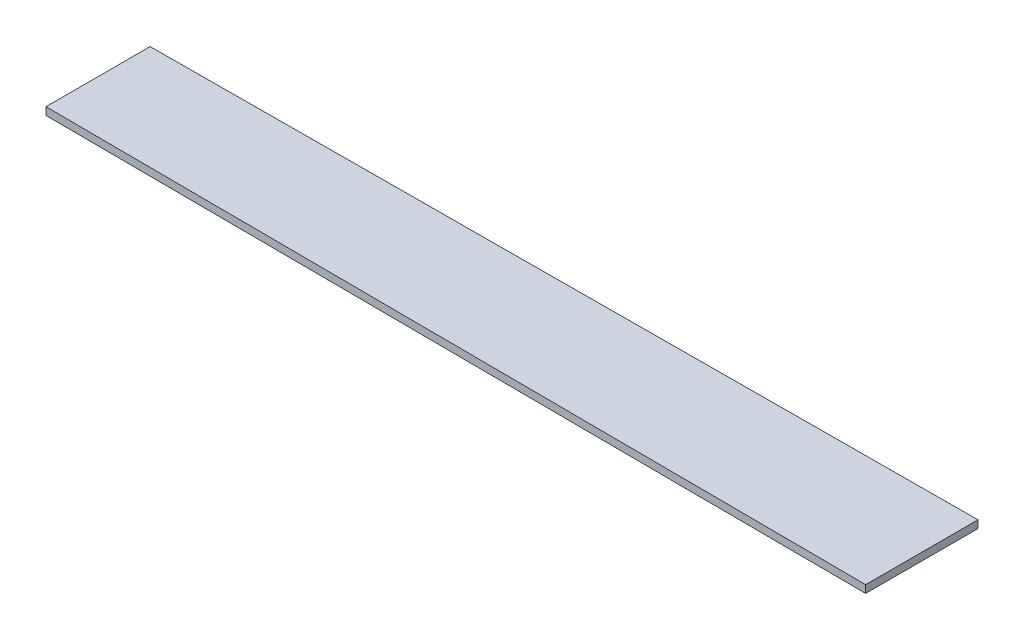
ISO-10303-21;
HEADER;
FILE_DESCRIPTION(('STEP AP214'),'2;1');
FILE_NAME('part.step','',(''),(''),'','','');
FILE_SCHEMA(('AUTOMOTIVE_DESIGN { 1 0 10303 214 1 1 1 1 }'));
ENDSEC;
DATA;
#1=APPLICATION_CONTEXT('core data for automotive mechanical design processes');
#2=APPLICATION_PROTOCOL_DEFINITION('international standard','automotive_design',2000,#1);
#3=PRODUCT_CONTEXT('',#1,'mechanical');
#4=PRODUCT('Part','Part','',(#3));
#5=PRODUCT_RELATED_PRODUCT_CATEGORY('part','',(#4));
#6=PRODUCT_DEFINITION_FORMATION('','',#4);
#7=PRODUCT_DEFINITION_CONTEXT('part definition',#1,'design');
#8=PRODUCT_DEFINITION('design','',#6,#7);
#9=PRODUCT_DEFINITION_SHAPE('','',#8);
#10=(LENGTH_UNIT() NAMED_UNIT(*) SI_UNIT(.MILLI.,.METRE.));
#11=(NAMED_UNIT(*) PLANE_ANGLE_UNIT() SI_UNIT($,.RADIAN.));
#12=(NAMED_UNIT(*) SI_UNIT($,.STERADIAN.) SOLID_ANGLE_UNIT());
#13=UNCERTAINTY_MEASURE_WITH_UNIT(LENGTH_MEASURE(1.E-05),#10,'distance_accuracy_value','');
#14=(GEOMETRIC_REPRESENTATION_CONTEXT(3) GLOBAL_UNCERTAINTY_ASSIGNED_CONTEXT((#13)) GLOBAL_UNIT_ASSIGNED_CONTEXT((#10,
#11,#12)) REPRESENTATION_CONTEXT('',''));
#15=CARTESIAN_POINT('',(0.,0.,0.));
#16=DIRECTION('',(0.,0.,1.));
#17=DIRECTION('',(1.,0.,0.));
#18=AXIS2_PLACEMENT_3D('',#15,#16,#17);
#19=CARTESIAN_POINT('',(0.,3.,22.1250000000059));
#20=DIRECTION('',(0.0049999375011962,0.,-0.99998750023437));
#21=DIRECTION('',(-0.99998750023437,0.,-0.0049999375011962));
#22=AXIS2_PLACEMENT_3D('',#19,#20,#21);
#23=PLANE('',#22);
#24=DIRECTION('',(0.99998750023437,0.,0.0049999375011962));
#25=VECTOR('',#24,1.);
#26=CARTESIAN_POINT('',(0.,0.,22.1250000000059));
#27=LINE('',#26,#25);
#28=CARTESIAN_POINT('',(-324.386118768319,0.,20.5030694061565));
#29=VERTEX_POINT('',#28);
#30=CARTESIAN_POINT('',(0.,0.,22.1250000000059));
#31=VERTEX_POINT('',#30);
#32=EDGE_CURVE('E100',#29,#31,#27,.T.);
#33=ORIENTED_EDGE('',*,*,#32,.T.);
#34=DIRECTION('',(0.,-1.,0.));
#35=VECTOR('',#34,1.);
#36=CARTESIAN_POINT('',(0.,3.,22.1250000000059));
#37=LINE('',#36,#35);
#38=CARTESIAN_POINT('',(0.,3.,22.1250000000059));
#39=VERTEX_POINT('',#38);
#40=EDGE_CURVE('E11',#39,#31,#37,.T.);
#41=ORIENTED_EDGE('',*,*,#40,.F.);
#42=DIRECTION('',(0.99998750023437,0.,0.0049999375011962));
#43=VECTOR('',#42,1.);
#44=CARTESIAN_POINT('',(0.,3.,22.1250000000059));
#45=LINE('',#44,#43);
#46=CARTESIAN_POINT('',(-324.386118768319,3.,20.5030694061565));
#47=VERTEX_POINT('',#46);
#48=EDGE_CURVE('E88',#47,#39,#45,.T.);
#49=ORIENTED_EDGE('',*,*,#48,.F.);
#50=DIRECTION('',(0.,-1.,0.));
#51=VECTOR('',#50,1.);
#52=CARTESIAN_POINT('',(-324.386118768319,3.,20.5030694061565));
#53=LINE('',#52,#51);
#54=EDGE_CURVE('E96',#47,#29,#53,.T.);
#55=ORIENTED_EDGE('',*,*,#54,.T.);
#56=EDGE_LOOP('',(#33,#41,#49,#55));
#57=FACE_BOUND('',#56,.T.);
#58=ADVANCED_FACE('F37',(#57),#23,.F.);
#59=CARTESIAN_POINT('',(0.,3.,22.1250000000059));
#60=DIRECTION('',(-1.,0.,0.));
#61=DIRECTION('',(0.,0.,1.));
#62=AXIS2_PLACEMENT_3D('',#59,#60,#61);
#63=PLANE('',#62);
#64=DIRECTION('',(0.,0.,-1.));
#65=VECTOR('',#64,1.);
#66=CARTESIAN_POINT('',(0.,0.,22.1250000000059));
#67=LINE('',#66,#65);
#68=CARTESIAN_POINT('',(0.,0.,-22.125000000006));
#69=VERTEX_POINT('',#68);
#70=EDGE_CURVE('E92',#31,#69,#67,.T.);
#71=ORIENTED_EDGE('',*,*,#70,.T.);
#72=DIRECTION('',(0.,-1.,0.));
#73=VECTOR('',#72,1.);
#74=CARTESIAN_POINT('',(0.,3.,-22.125000000006));
#75=LINE('',#74,#73);
#76=CARTESIAN_POINT('',(0.,3.,-22.125000000006));
#77=VERTEX_POINT('',#76);
#78=EDGE_CURVE('E45',#77,#69,#75,.T.);
#79=ORIENTED_EDGE('',*,*,#78,.F.);
#80=DIRECTION('',(0.,0.,-1.));
#81=VECTOR('',#80,1.);
#82=CARTESIAN_POINT('',(0.,3.,22.1250000000059));
#83=LINE('',#82,#81);
#84=EDGE_CURVE('E83',#39,#77,#83,.T.);
#85=ORIENTED_EDGE('',*,*,#84,.F.);
#86=ORIENTED_EDGE('',*,*,#40,.T.);
#87=EDGE_LOOP('',(#71,#79,#85,#86));
#88=FACE_BOUND('',#87,.T.);
#89=ADVANCED_FACE('F91',(#88),#63,.F.);
#90=CARTESIAN_POINT('',(0.,3.,-22.125000000006));
#91=DIRECTION('',(0.0049999375011962,0.,0.99998750023437));
#92=DIRECTION('',(0.99998750023437,0.,-0.0049999375011962));
#93=AXIS2_PLACEMENT_3D('',#90,#91,#92);
#94=PLANE('',#93);
#95=DIRECTION('',(-0.99998750023437,0.,0.0049999375011962));
#96=VECTOR('',#95,1.);
#97=CARTESIAN_POINT('',(0.,0.,-22.125000000006));
#98=LINE('',#97,#96);
#99=CARTESIAN_POINT('',(-324.386118768319,0.,-20.5030694061565));
#100=VERTEX_POINT('',#99);
#101=EDGE_CURVE('E70',#69,#100,#98,.T.);
#102=ORIENTED_EDGE('',*,*,#101,.T.);
#103=DIRECTION('',(0.,-1.,0.));
#104=VECTOR('',#103,1.);
#105=CARTESIAN_POINT('',(-324.386118768319,3.,-20.5030694061565));
#106=LINE('',#105,#104);
#107=CARTESIAN_POINT('',(-324.386118768319,3.,-20.5030694061565));
#108=VERTEX_POINT('',#107);
#109=EDGE_CURVE('E93',#108,#100,#106,.T.);
#110=ORIENTED_EDGE('',*,*,#109,.F.);
#111=DIRECTION('',(-0.99998750023437,0.,0.0049999375011962));
#112=VECTOR('',#111,1.);
#113=CARTESIAN_POINT('',(0.,3.,-22.125000000006));
#114=LINE('',#113,#112);
#115=EDGE_CURVE('E86',#77,#108,#114,.T.);
#116=ORIENTED_EDGE('',*,*,#115,.F.);
#117=ORIENTED_EDGE('',*,*,#78,.T.);
#118=EDGE_LOOP('',(#102,#110,#116,#117));
#119=FACE_BOUND('',#118,.T.);
#120=ADVANCED_FACE('F94',(#119),#94,.F.);
#121=CARTESIAN_POINT('',(-324.386118768319,3.,20.5030694061565));
#122=DIRECTION('',(1.,0.,0.));
#123=DIRECTION('',(0.,0.,-1.));
#124=AXIS2_PLACEMENT_3D('',#121,#122,#123);
#125=PLANE('',#124);
#126=DIRECTION('',(0.,0.,1.));
#127=VECTOR('',#126,1.);
#128=CARTESIAN_POINT('',(-324.386118768319,0.,20.5030694061565));
#129=LINE('',#128,#127);
#130=EDGE_CURVE('E76',#100,#29,#129,.T.);
#131=ORIENTED_EDGE('',*,*,#130,.T.);
#132=ORIENTED_EDGE('',*,*,#54,.F.);
#133=DIRECTION('',(0.,0.,1.));
#134=VECTOR('',#133,1.);
#135=CARTESIAN_POINT('',(-324.386118768319,3.,20.5030694061565));
#136=LINE('',#135,#134);
#137=EDGE_CURVE('E53',#108,#47,#136,.T.);
#138=ORIENTED_EDGE('',*,*,#137,.F.);
#139=ORIENTED_EDGE('',*,*,#109,.T.);
#140=EDGE_LOOP('',(#131,#132,#138,#139));
#141=FACE_BOUND('',#140,.T.);
#142=ADVANCED_FACE('F107',(#141),#125,.F.);
#143=CARTESIAN_POINT('',(0.,3.,0.));
#144=DIRECTION('',(0.,-1.,0.));
#145=DIRECTION('',(0.,0.,-1.));
#146=AXIS2_PLACEMENT_3D('',#143,#144,#145);
#147=PLANE('',#146);
#148=ORIENTED_EDGE('',*,*,#48,.T.);
#149=ORIENTED_EDGE('',*,*,#84,.T.);
#150=ORIENTED_EDGE('',*,*,#115,.T.);
#151=ORIENTED_EDGE('',*,*,#137,.T.);
#152=EDGE_LOOP('',(#148,#149,#150,#151));
#153=FACE_BOUND('',#152,.T.);
#154=ADVANCED_FACE('F84',(#153),#147,.F.);
#155=CARTESIAN_POINT('',(0.,0.,0.));
#156=DIRECTION('',(0.,-1.,0.));
#157=DIRECTION('',(0.,0.,-1.));
#158=AXIS2_PLACEMENT_3D('',#155,#156,#157);
#159=PLANE('',#158);
#160=ORIENTED_EDGE('',*,*,#32,.F.);
#161=ORIENTED_EDGE('',*,*,#130,.F.);
#162=ORIENTED_EDGE('',*,*,#101,.F.);
#163=ORIENTED_EDGE('',*,*,#70,.F.);
#164=EDGE_LOOP('',(#160,#161,#162,#163));
#165=FACE_BOUND('',#164,.T.);
#166=ADVANCED_FACE('F110',(#165),#159,.T.);
#167=CLOSED_SHELL('',(#58,#89,#120,#142,#154,#166));
#168=MANIFOLD_SOLID_BREP('B2',#167);
#169=ADVANCED_BREP_SHAPE_REPRESENTATION('',(#18,#168),#14);
#170=SHAPE_DEFINITION_REPRESENTATION(#9,#169);
ENDSEC;
END-ISO-10303-21;
